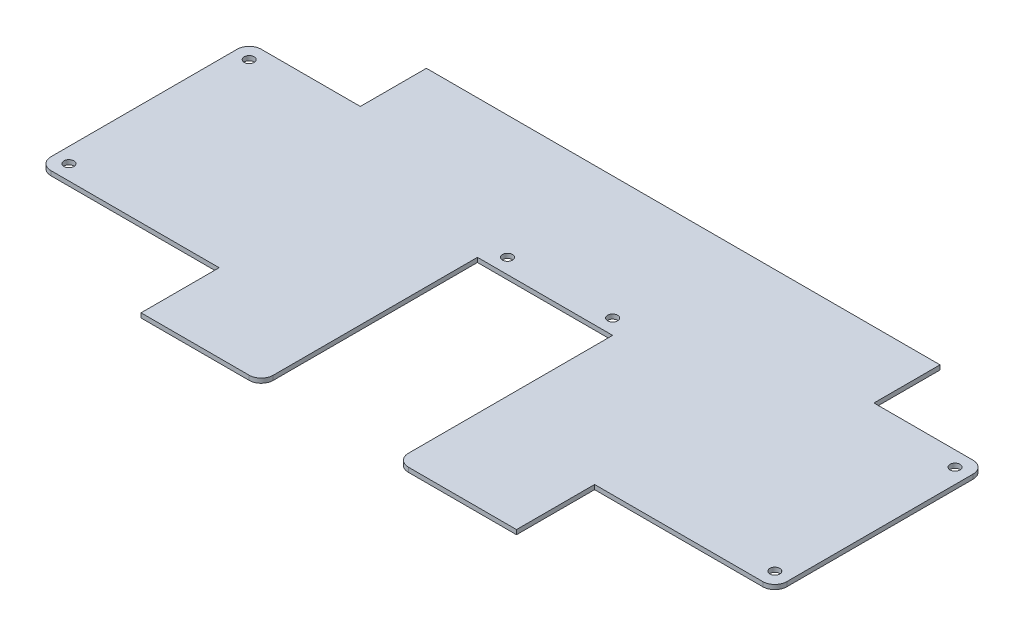
ISO-10303-21;
HEADER;
FILE_DESCRIPTION(('STEP AP214'),'2;1');
FILE_NAME('part.step','',(''),(''),'','','');
FILE_SCHEMA(('AUTOMOTIVE_DESIGN { 1 0 10303 214 1 1 1 1 }'));
ENDSEC;
DATA;
#1=APPLICATION_CONTEXT('core data for automotive mechanical design processes');
#2=APPLICATION_PROTOCOL_DEFINITION('international standard','automotive_design',2000,#1);
#3=PRODUCT_CONTEXT('',#1,'mechanical');
#4=PRODUCT('Part','Part','',(#3));
#5=PRODUCT_RELATED_PRODUCT_CATEGORY('part','',(#4));
#6=PRODUCT_DEFINITION_FORMATION('','',#4);
#7=PRODUCT_DEFINITION_CONTEXT('part definition',#1,'design');
#8=PRODUCT_DEFINITION('design','',#6,#7);
#9=PRODUCT_DEFINITION_SHAPE('','',#8);
#10=(LENGTH_UNIT() NAMED_UNIT(*) SI_UNIT(.MILLI.,.METRE.));
#11=(NAMED_UNIT(*) PLANE_ANGLE_UNIT() SI_UNIT($,.RADIAN.));
#12=(NAMED_UNIT(*) SI_UNIT($,.STERADIAN.) SOLID_ANGLE_UNIT());
#13=UNCERTAINTY_MEASURE_WITH_UNIT(LENGTH_MEASURE(1.E-05),#10,'distance_accuracy_value','');
#14=(GEOMETRIC_REPRESENTATION_CONTEXT(3) GLOBAL_UNCERTAINTY_ASSIGNED_CONTEXT((#13)) GLOBAL_UNIT_ASSIGNED_CONTEXT((#10,
#11,#12)) REPRESENTATION_CONTEXT('',''));
#15=CARTESIAN_POINT('',(0.,0.,0.));
#16=DIRECTION('',(0.,0.,1.));
#17=DIRECTION('',(1.,0.,0.));
#18=AXIS2_PLACEMENT_3D('',#15,#16,#17);
#19=CARTESIAN_POINT('',(0.,1.5,0.));
#20=DIRECTION('',(0.,0.,-1.));
#21=DIRECTION('',(-1.,0.,0.));
#22=AXIS2_PLACEMENT_3D('',#19,#20,#21);
#23=PLANE('',#22);
#24=DIRECTION('',(1.,0.,0.));
#25=VECTOR('',#24,1.);
#26=CARTESIAN_POINT('',(0.,0.,0.));
#27=LINE('',#26,#25);
#28=CARTESIAN_POINT('',(60.,0.,0.));
#29=VERTEX_POINT('',#28);
#30=CARTESIAN_POINT('',(96.,0.,0.));
#31=VERTEX_POINT('',#30);
#32=EDGE_CURVE('E186',#29,#31,#27,.T.);
#33=ORIENTED_EDGE('',*,*,#32,.T.);
#34=DIRECTION('',(0.,1.,0.));
#35=VECTOR('',#34,1.);
#36=CARTESIAN_POINT('',(96.,1.5,0.));
#37=LINE('',#36,#35);
#38=CARTESIAN_POINT('',(96.,1.5,0.));
#39=VERTEX_POINT('',#38);
#40=EDGE_CURVE('E293',#31,#39,#37,.T.);
#41=ORIENTED_EDGE('',*,*,#40,.T.);
#42=DIRECTION('',(1.,0.,0.));
#43=VECTOR('',#42,1.);
#44=CARTESIAN_POINT('',(0.,1.5,0.));
#45=LINE('',#44,#43);
#46=CARTESIAN_POINT('',(60.,1.5,0.));
#47=VERTEX_POINT('',#46);
#48=EDGE_CURVE('E286',#47,#39,#45,.T.);
#49=ORIENTED_EDGE('',*,*,#48,.F.);
#50=DIRECTION('',(0.,1.,0.));
#51=VECTOR('',#50,1.);
#52=CARTESIAN_POINT('',(60.,0.,0.));
#53=LINE('',#52,#51);
#54=EDGE_CURVE('E241',#29,#47,#53,.T.);
#55=ORIENTED_EDGE('',*,*,#54,.F.);
#56=EDGE_LOOP('',(#33,#41,#49,#55));
#57=FACE_BOUND('',#56,.T.);
#58=ADVANCED_FACE('F33',(#57),#23,.F.);
#59=CARTESIAN_POINT('',(0.,1.5,0.));
#60=DIRECTION('',(1.,0.,0.));
#61=DIRECTION('',(0.,0.,-1.));
#62=AXIS2_PLACEMENT_3D('',#59,#60,#61);
#63=PLANE('',#62);
#64=DIRECTION('',(0.,0.,1.));
#65=VECTOR('',#64,1.);
#66=CARTESIAN_POINT('',(0.,0.,0.));
#67=LINE('',#66,#65);
#68=CARTESIAN_POINT('',(0.,0.,-92.));
#69=VERTEX_POINT('',#68);
#70=CARTESIAN_POINT('',(0.,0.,-30.));
#71=VERTEX_POINT('',#70);
#72=EDGE_CURVE('E187',#69,#71,#67,.T.);
#73=ORIENTED_EDGE('',*,*,#72,.T.);
#74=DIRECTION('',(0.,1.,0.));
#75=VECTOR('',#74,1.);
#76=CARTESIAN_POINT('',(0.,1.5,-30.));
#77=LINE('',#76,#75);
#78=CARTESIAN_POINT('',(0.,1.5,-30.));
#79=VERTEX_POINT('',#78);
#80=EDGE_CURVE('E344',#71,#79,#77,.T.);
#81=ORIENTED_EDGE('',*,*,#80,.T.);
#82=DIRECTION('',(0.,0.,1.));
#83=VECTOR('',#82,1.);
#84=CARTESIAN_POINT('',(0.,1.5,0.));
#85=LINE('',#84,#83);
#86=CARTESIAN_POINT('',(0.,1.5,-92.));
#87=VERTEX_POINT('',#86);
#88=EDGE_CURVE('E280',#87,#79,#85,.T.);
#89=ORIENTED_EDGE('',*,*,#88,.F.);
#90=DIRECTION('',(0.,1.,0.));
#91=VECTOR('',#90,1.);
#92=CARTESIAN_POINT('',(0.,1.5,-92.));
#93=LINE('',#92,#91);
#94=EDGE_CURVE('E342',#87,#69,#93,.F.);
#95=ORIENTED_EDGE('',*,*,#94,.T.);
#96=EDGE_LOOP('',(#73,#81,#89,#95));
#97=FACE_BOUND('',#96,.T.);
#98=ADVANCED_FACE('F359',(#97),#63,.F.);
#99=CARTESIAN_POINT('',(149.,1.5,0.));
#100=VERTEX_POINT('',#99);
#101=CARTESIAN_POINT('',(185.,1.5,0.));
#102=VERTEX_POINT('',#101);
#103=EDGE_CURVE('E283',#100,#102,#45,.T.);
#104=ORIENTED_EDGE('',*,*,#103,.F.);
#105=DIRECTION('',(0.,1.,0.));
#106=VECTOR('',#105,1.);
#107=CARTESIAN_POINT('',(149.,1.5,0.));
#108=LINE('',#107,#106);
#109=CARTESIAN_POINT('',(149.,0.,0.));
#110=VERTEX_POINT('',#109);
#111=EDGE_CURVE('E56',#100,#110,#108,.F.);
#112=ORIENTED_EDGE('',*,*,#111,.T.);
#113=CARTESIAN_POINT('',(185.,0.,0.));
#114=VERTEX_POINT('',#113);
#115=EDGE_CURVE('E181',#110,#114,#27,.T.);
#116=ORIENTED_EDGE('',*,*,#115,.T.);
#117=DIRECTION('',(0.,1.,0.));
#118=VECTOR('',#117,1.);
#119=CARTESIAN_POINT('',(185.,0.,0.));
#120=LINE('',#119,#118);
#121=EDGE_CURVE('E184',#114,#102,#120,.T.);
#122=ORIENTED_EDGE('',*,*,#121,.T.);
#123=EDGE_LOOP('',(#104,#112,#116,#122));
#124=FACE_BOUND('',#123,.T.);
#125=ADVANCED_FACE('F183',(#124),#23,.F.);
#126=CARTESIAN_POINT('',(245.,1.5,0.));
#127=DIRECTION('',(-1.,0.,0.));
#128=DIRECTION('',(0.,0.,1.));
#129=AXIS2_PLACEMENT_3D('',#126,#127,#128);
#130=PLANE('',#129);
#131=DIRECTION('',(0.,0.,-1.));
#132=VECTOR('',#131,1.);
#133=CARTESIAN_POINT('',(245.,1.5,0.));
#134=LINE('',#133,#132);
#135=CARTESIAN_POINT('',(245.,1.5,-30.));
#136=VERTEX_POINT('',#135);
#137=CARTESIAN_POINT('',(245.,1.5,-92.));
#138=VERTEX_POINT('',#137);
#139=EDGE_CURVE('E287',#136,#138,#134,.T.);
#140=ORIENTED_EDGE('',*,*,#139,.F.);
#141=DIRECTION('',(0.,1.,0.));
#142=VECTOR('',#141,1.);
#143=CARTESIAN_POINT('',(245.,1.5,-30.));
#144=LINE('',#143,#142);
#145=CARTESIAN_POINT('',(245.,0.,-30.));
#146=VERTEX_POINT('',#145);
#147=EDGE_CURVE('E338',#136,#146,#144,.F.);
#148=ORIENTED_EDGE('',*,*,#147,.T.);
#149=DIRECTION('',(0.,0.,-1.));
#150=VECTOR('',#149,1.);
#151=CARTESIAN_POINT('',(245.,0.,0.));
#152=LINE('',#151,#150);
#153=CARTESIAN_POINT('',(245.,0.,-92.));
#154=VERTEX_POINT('',#153);
#155=EDGE_CURVE('E296',#146,#154,#152,.T.);
#156=ORIENTED_EDGE('',*,*,#155,.T.);
#157=DIRECTION('',(0.,1.,0.));
#158=VECTOR('',#157,1.);
#159=CARTESIAN_POINT('',(245.,1.5,-92.));
#160=LINE('',#159,#158);
#161=EDGE_CURVE('E335',#154,#138,#160,.T.);
#162=ORIENTED_EDGE('',*,*,#161,.T.);
#163=EDGE_LOOP('',(#140,#148,#156,#162));
#164=FACE_BOUND('',#163,.T.);
#165=ADVANCED_FACE('F395',(#164),#130,.F.);
#166=CARTESIAN_POINT('',(0.,1.5,-118.));
#167=DIRECTION('',(0.,0.,1.));
#168=DIRECTION('',(1.,0.,0.));
#169=AXIS2_PLACEMENT_3D('',#166,#167,#168);
#170=PLANE('',#169);
#171=DIRECTION('',(-1.,0.,0.));
#172=VECTOR('',#171,1.);
#173=CARTESIAN_POINT('',(0.,1.5,-118.));
#174=LINE('',#173,#172);
#175=CARTESIAN_POINT('',(208.,1.5,-118.));
#176=VERTEX_POINT('',#175);
#177=CARTESIAN_POINT('',(37.,1.5,-118.));
#178=VERTEX_POINT('',#177);
#179=EDGE_CURVE('E290',#176,#178,#174,.T.);
#180=ORIENTED_EDGE('',*,*,#179,.F.);
#181=DIRECTION('',(0.,1.,0.));
#182=VECTOR('',#181,1.);
#183=CARTESIAN_POINT('',(208.,0.,-118.));
#184=LINE('',#183,#182);
#185=CARTESIAN_POINT('',(208.,0.,-118.));
#186=VERTEX_POINT('',#185);
#187=EDGE_CURVE('E259',#186,#176,#184,.T.);
#188=ORIENTED_EDGE('',*,*,#187,.F.);
#189=DIRECTION('',(-1.,0.,0.));
#190=VECTOR('',#189,1.);
#191=CARTESIAN_POINT('',(0.,0.,-118.));
#192=LINE('',#191,#190);
#193=CARTESIAN_POINT('',(37.,0.,-118.));
#194=VERTEX_POINT('',#193);
#195=EDGE_CURVE('E284',#186,#194,#192,.T.);
#196=ORIENTED_EDGE('',*,*,#195,.T.);
#197=DIRECTION('',(0.,1.,0.));
#198=VECTOR('',#197,1.);
#199=CARTESIAN_POINT('',(37.,0.,-118.));
#200=LINE('',#199,#198);
#201=EDGE_CURVE('E275',#194,#178,#200,.T.);
#202=ORIENTED_EDGE('',*,*,#201,.T.);
#203=EDGE_LOOP('',(#180,#188,#196,#202));
#204=FACE_BOUND('',#203,.T.);
#205=ADVANCED_FACE('F379',(#204),#170,.F.);
#206=CARTESIAN_POINT('',(0.,1.5,0.));
#207=DIRECTION('',(0.,-1.,0.));
#208=DIRECTION('',(0.,0.,-1.));
#209=AXIS2_PLACEMENT_3D('',#206,#207,#208);
#210=PLANE('',#209);
#211=CARTESIAN_POINT('',(5.,1.5,-91.));
#212=DIRECTION('',(0.,-1.,0.));
#213=DIRECTION('',(0.,0.,-1.));
#214=AXIS2_PLACEMENT_3D('',#211,#212,#213);
#215=CIRCLE('',#214,1.65);
#216=CARTESIAN_POINT('',(5.,1.5,-92.65));
#217=VERTEX_POINT('',#216);
#218=EDGE_CURVE('E227',#217,#217,#215,.T.);
#219=ORIENTED_EDGE('',*,*,#218,.T.);
#220=EDGE_LOOP('',(#219));
#221=FACE_BOUND('',#220,.T.);
#222=CARTESIAN_POINT('',(105.,1.5,-77.));
#223=DIRECTION('',(0.,-1.,0.));
#224=DIRECTION('',(0.,0.,-1.));
#225=AXIS2_PLACEMENT_3D('',#222,#223,#224);
#226=CIRCLE('',#225,1.65);
#227=CARTESIAN_POINT('',(105.,1.5,-78.65));
#228=VERTEX_POINT('',#227);
#229=EDGE_CURVE('E689',#228,#228,#226,.T.);
#230=ORIENTED_EDGE('',*,*,#229,.T.);
#231=EDGE_LOOP('',(#230));
#232=FACE_BOUND('',#231,.T.);
#233=CARTESIAN_POINT('',(140.,1.5,-77.));
#234=DIRECTION('',(0.,-1.,0.));
#235=DIRECTION('',(0.,0.,-1.));
#236=AXIS2_PLACEMENT_3D('',#233,#234,#235);
#237=CIRCLE('',#236,1.65000000000002);
#238=CARTESIAN_POINT('',(140.,1.5,-78.65));
#239=VERTEX_POINT('',#238);
#240=EDGE_CURVE('E691',#239,#239,#237,.T.);
#241=ORIENTED_EDGE('',*,*,#240,.T.);
#242=EDGE_LOOP('',(#241));
#243=FACE_BOUND('',#242,.T.);
#244=CARTESIAN_POINT('',(240.,1.5,-31.));
#245=DIRECTION('',(0.,-1.,0.));
#246=DIRECTION('',(0.,0.,-1.));
#247=AXIS2_PLACEMENT_3D('',#244,#245,#246);
#248=CIRCLE('',#247,1.65000000000002);
#249=CARTESIAN_POINT('',(240.,1.5,-32.65));
#250=VERTEX_POINT('',#249);
#251=EDGE_CURVE('E696',#250,#250,#248,.T.);
#252=ORIENTED_EDGE('',*,*,#251,.T.);
#253=EDGE_LOOP('',(#252));
#254=FACE_BOUND('',#253,.T.);
#255=CARTESIAN_POINT('',(240.,1.5,-91.));
#256=DIRECTION('',(0.,-1.,0.));
#257=DIRECTION('',(0.,0.,-1.));
#258=AXIS2_PLACEMENT_3D('',#255,#256,#257);
#259=CIRCLE('',#258,1.65000000000002);
#260=CARTESIAN_POINT('',(240.,1.5,-92.65));
#261=VERTEX_POINT('',#260);
#262=EDGE_CURVE('E699',#261,#261,#259,.T.);
#263=ORIENTED_EDGE('',*,*,#262,.T.);
#264=EDGE_LOOP('',(#263));
#265=FACE_BOUND('',#264,.T.);
#266=CARTESIAN_POINT('',(5.,1.5,-31.));
#267=DIRECTION('',(0.,-1.,0.));
#268=DIRECTION('',(0.,0.,-1.));
#269=AXIS2_PLACEMENT_3D('',#266,#267,#268);
#270=CIRCLE('',#269,1.65);
#271=CARTESIAN_POINT('',(5.,1.5,-32.65));
#272=VERTEX_POINT('',#271);
#273=EDGE_CURVE('E702',#272,#272,#270,.T.);
#274=ORIENTED_EDGE('',*,*,#273,.T.);
#275=EDGE_LOOP('',(#274));
#276=FACE_BOUND('',#275,.T.);
#277=ORIENTED_EDGE('',*,*,#48,.T.);
#278=CARTESIAN_POINT('',(96.,1.5,-4.));
#279=DIRECTION('',(0.,-1.,0.));
#280=DIRECTION('',(0.,0.,-1.));
#281=AXIS2_PLACEMENT_3D('',#278,#279,#280);
#282=CIRCLE('',#281,4.);
#283=CARTESIAN_POINT('',(100.,1.5,-4.));
#284=VERTEX_POINT('',#283);
#285=EDGE_CURVE('E313',#39,#284,#282,.F.);
#286=ORIENTED_EDGE('',*,*,#285,.T.);
#287=DIRECTION('',(0.,0.,1.));
#288=VECTOR('',#287,1.);
#289=CARTESIAN_POINT('',(100.,1.5,0.));
#290=LINE('',#289,#288);
#291=CARTESIAN_POINT('',(100.,1.5,-72.));
#292=VERTEX_POINT('',#291);
#293=EDGE_CURVE('E223',#292,#284,#290,.T.);
#294=ORIENTED_EDGE('',*,*,#293,.F.);
#295=DIRECTION('',(-1.,0.,0.));
#296=VECTOR('',#295,1.);
#297=CARTESIAN_POINT('',(100.,1.5,-72.));
#298=LINE('',#297,#296);
#299=CARTESIAN_POINT('',(145.,1.5,-72.));
#300=VERTEX_POINT('',#299);
#301=EDGE_CURVE('E217',#300,#292,#298,.T.);
#302=ORIENTED_EDGE('',*,*,#301,.F.);
#303=DIRECTION('',(0.,0.,-1.));
#304=VECTOR('',#303,1.);
#305=CARTESIAN_POINT('',(145.,1.5,0.));
#306=LINE('',#305,#304);
#307=CARTESIAN_POINT('',(145.,1.5,-4.));
#308=VERTEX_POINT('',#307);
#309=EDGE_CURVE('E226',#308,#300,#306,.T.);
#310=ORIENTED_EDGE('',*,*,#309,.F.);
#311=CARTESIAN_POINT('',(149.,1.5,-4.));
#312=DIRECTION('',(0.,-1.,0.));
#313=DIRECTION('',(0.,0.,-1.));
#314=AXIS2_PLACEMENT_3D('',#311,#312,#313);
#315=CIRCLE('',#314,4.);
#316=EDGE_CURVE('E311',#308,#100,#315,.F.);
#317=ORIENTED_EDGE('',*,*,#316,.T.);
#318=ORIENTED_EDGE('',*,*,#103,.T.);
#319=DIRECTION('',(0.,0.,1.));
#320=VECTOR('',#319,1.);
#321=CARTESIAN_POINT('',(185.,1.5,0.));
#322=LINE('',#321,#320);
#323=CARTESIAN_POINT('',(185.,1.5,-26.));
#324=VERTEX_POINT('',#323);
#325=EDGE_CURVE('E197',#324,#102,#322,.T.);
#326=ORIENTED_EDGE('',*,*,#325,.F.);
#327=DIRECTION('',(-1.,0.,0.));
#328=VECTOR('',#327,1.);
#329=CARTESIAN_POINT('',(245.,1.5,-26.));
#330=LINE('',#329,#328);
#331=CARTESIAN_POINT('',(241.,1.5,-26.));
#332=VERTEX_POINT('',#331);
#333=EDGE_CURVE('E210',#332,#324,#330,.T.);
#334=ORIENTED_EDGE('',*,*,#333,.F.);
#335=CARTESIAN_POINT('',(241.,1.5,-30.));
#336=DIRECTION('',(0.,-1.,0.));
#337=DIRECTION('',(0.,0.,-1.));
#338=AXIS2_PLACEMENT_3D('',#335,#336,#337);
#339=CIRCLE('',#338,4.);
#340=EDGE_CURVE('E309',#332,#136,#339,.F.);
#341=ORIENTED_EDGE('',*,*,#340,.T.);
#342=ORIENTED_EDGE('',*,*,#139,.T.);
#343=CARTESIAN_POINT('',(241.,1.5,-92.));
#344=DIRECTION('',(0.,-1.,0.));
#345=DIRECTION('',(0.,0.,-1.));
#346=AXIS2_PLACEMENT_3D('',#343,#344,#345);
#347=CIRCLE('',#346,4.);
#348=CARTESIAN_POINT('',(241.,1.5,-96.));
#349=VERTEX_POINT('',#348);
#350=EDGE_CURVE('E307',#138,#349,#347,.F.);
#351=ORIENTED_EDGE('',*,*,#350,.T.);
#352=DIRECTION('',(1.,0.,0.));
#353=VECTOR('',#352,1.);
#354=CARTESIAN_POINT('',(245.,1.5,-96.));
#355=LINE('',#354,#353);
#356=CARTESIAN_POINT('',(208.,1.5,-96.));
#357=VERTEX_POINT('',#356);
#358=EDGE_CURVE('E256',#357,#349,#355,.T.);
#359=ORIENTED_EDGE('',*,*,#358,.F.);
#360=DIRECTION('',(0.,0.,1.));
#361=VECTOR('',#360,1.);
#362=CARTESIAN_POINT('',(208.,1.5,-118.));
#363=LINE('',#362,#361);
#364=EDGE_CURVE('E198',#176,#357,#363,.T.);
#365=ORIENTED_EDGE('',*,*,#364,.F.);
#366=ORIENTED_EDGE('',*,*,#179,.T.);
#367=DIRECTION('',(0.,0.,-1.));
#368=VECTOR('',#367,1.);
#369=CARTESIAN_POINT('',(37.,1.5,-118.));
#370=LINE('',#369,#368);
#371=CARTESIAN_POINT('',(37.,1.5,-96.));
#372=VERTEX_POINT('',#371);
#373=EDGE_CURVE('E269',#372,#178,#370,.T.);
#374=ORIENTED_EDGE('',*,*,#373,.F.);
#375=DIRECTION('',(1.,0.,0.));
#376=VECTOR('',#375,1.);
#377=CARTESIAN_POINT('',(0.,1.5,-96.));
#378=LINE('',#377,#376);
#379=CARTESIAN_POINT('',(4.,1.5,-96.));
#380=VERTEX_POINT('',#379);
#381=EDGE_CURVE('E250',#380,#372,#378,.T.);
#382=ORIENTED_EDGE('',*,*,#381,.F.);
#383=CARTESIAN_POINT('',(4.,1.5,-92.));
#384=DIRECTION('',(0.,-1.,0.));
#385=DIRECTION('',(0.,0.,-1.));
#386=AXIS2_PLACEMENT_3D('',#383,#384,#385);
#387=CIRCLE('',#386,4.);
#388=EDGE_CURVE('E303',#380,#87,#387,.F.);
#389=ORIENTED_EDGE('',*,*,#388,.T.);
#390=ORIENTED_EDGE('',*,*,#88,.T.);
#391=CARTESIAN_POINT('',(4.,1.5,-30.));
#392=DIRECTION('',(0.,-1.,0.));
#393=DIRECTION('',(0.,0.,-1.));
#394=AXIS2_PLACEMENT_3D('',#391,#392,#393);
#395=CIRCLE('',#394,4.);
#396=CARTESIAN_POINT('',(4.,1.5,-26.));
#397=VERTEX_POINT('',#396);
#398=EDGE_CURVE('E305',#79,#397,#395,.F.);
#399=ORIENTED_EDGE('',*,*,#398,.T.);
#400=DIRECTION('',(-1.,0.,0.));
#401=VECTOR('',#400,1.);
#402=CARTESIAN_POINT('',(0.,1.5,-26.));
#403=LINE('',#402,#401);
#404=CARTESIAN_POINT('',(60.,1.5,-26.));
#405=VERTEX_POINT('',#404);
#406=EDGE_CURVE('E238',#405,#397,#403,.T.);
#407=ORIENTED_EDGE('',*,*,#406,.F.);
#408=DIRECTION('',(0.,0.,-1.));
#409=VECTOR('',#408,1.);
#410=CARTESIAN_POINT('',(60.,1.5,0.));
#411=LINE('',#410,#409);
#412=EDGE_CURVE('E242',#47,#405,#411,.T.);
#413=ORIENTED_EDGE('',*,*,#412,.F.);
#414=EDGE_LOOP('',(#277,#286,#294,#302,#310,#317,#318,#326,#334,#341,#342,#351,#359,#365,#366,
#374,#382,#389,#390,#399,#407,#413));
#415=FACE_BOUND('',#414,.T.);
#416=ADVANCED_FACE('F363',(#221,#232,#243,#254,#265,#276,#415),#210,.F.);
#417=CARTESIAN_POINT('',(0.,0.,0.));
#418=DIRECTION('',(0.,-1.,0.));
#419=DIRECTION('',(0.,0.,-1.));
#420=AXIS2_PLACEMENT_3D('',#417,#418,#419);
#421=PLANE('',#420);
#422=CARTESIAN_POINT('',(5.,0.,-91.));
#423=DIRECTION('',(0.,-1.,0.));
#424=DIRECTION('',(0.,0.,-1.));
#425=AXIS2_PLACEMENT_3D('',#422,#423,#424);
#426=CIRCLE('',#425,1.65);
#427=CARTESIAN_POINT('',(5.,0.,-92.65));
#428=VERTEX_POINT('',#427);
#429=EDGE_CURVE('E686',#428,#428,#426,.T.);
#430=ORIENTED_EDGE('',*,*,#429,.F.);
#431=EDGE_LOOP('',(#430));
#432=FACE_BOUND('',#431,.T.);
#433=CARTESIAN_POINT('',(105.,0.,-77.));
#434=DIRECTION('',(0.,-1.,0.));
#435=DIRECTION('',(0.,0.,-1.));
#436=AXIS2_PLACEMENT_3D('',#433,#434,#435);
#437=CIRCLE('',#436,1.65);
#438=CARTESIAN_POINT('',(105.,0.,-78.65));
#439=VERTEX_POINT('',#438);
#440=EDGE_CURVE('E715',#439,#439,#437,.T.);
#441=ORIENTED_EDGE('',*,*,#440,.F.);
#442=EDGE_LOOP('',(#441));
#443=FACE_BOUND('',#442,.T.);
#444=CARTESIAN_POINT('',(140.,0.,-77.));
#445=DIRECTION('',(0.,-1.,0.));
#446=DIRECTION('',(0.,0.,-1.));
#447=AXIS2_PLACEMENT_3D('',#444,#445,#446);
#448=CIRCLE('',#447,1.65000000000002);
#449=CARTESIAN_POINT('',(140.,0.,-78.65));
#450=VERTEX_POINT('',#449);
#451=EDGE_CURVE('E711',#450,#450,#448,.T.);
#452=ORIENTED_EDGE('',*,*,#451,.F.);
#453=EDGE_LOOP('',(#452));
#454=FACE_BOUND('',#453,.T.);
#455=CARTESIAN_POINT('',(240.,0.,-31.));
#456=DIRECTION('',(0.,-1.,0.));
#457=DIRECTION('',(0.,0.,1.));
#458=AXIS2_PLACEMENT_3D('',#455,#456,#457);
#459=CIRCLE('',#458,1.65000000000002);
#460=CARTESIAN_POINT('',(240.,0.,-29.35));
#461=VERTEX_POINT('',#460);
#462=EDGE_CURVE('E708',#461,#461,#459,.T.);
#463=ORIENTED_EDGE('',*,*,#462,.F.);
#464=EDGE_LOOP('',(#463));
#465=FACE_BOUND('',#464,.T.);
#466=CARTESIAN_POINT('',(240.,0.,-91.));
#467=DIRECTION('',(0.,-1.,0.));
#468=DIRECTION('',(0.,0.,1.));
#469=AXIS2_PLACEMENT_3D('',#466,#467,#468);
#470=CIRCLE('',#469,1.65000000000002);
#471=CARTESIAN_POINT('',(240.,0.,-89.35));
#472=VERTEX_POINT('',#471);
#473=EDGE_CURVE('E712',#472,#472,#470,.T.);
#474=ORIENTED_EDGE('',*,*,#473,.F.);
#475=EDGE_LOOP('',(#474));
#476=FACE_BOUND('',#475,.T.);
#477=CARTESIAN_POINT('',(5.,0.,-31.));
#478=DIRECTION('',(0.,-1.,0.));
#479=DIRECTION('',(0.,0.,-1.));
#480=AXIS2_PLACEMENT_3D('',#477,#478,#479);
#481=CIRCLE('',#480,1.65);
#482=CARTESIAN_POINT('',(5.,0.,-32.65));
#483=VERTEX_POINT('',#482);
#484=EDGE_CURVE('E705',#483,#483,#481,.T.);
#485=ORIENTED_EDGE('',*,*,#484,.F.);
#486=EDGE_LOOP('',(#485));
#487=FACE_BOUND('',#486,.T.);
#488=DIRECTION('',(0.,0.,1.));
#489=VECTOR('',#488,1.);
#490=CARTESIAN_POINT('',(100.,0.,0.));
#491=LINE('',#490,#489);
#492=CARTESIAN_POINT('',(100.,0.,-72.));
#493=VERTEX_POINT('',#492);
#494=CARTESIAN_POINT('',(100.,0.,-4.));
#495=VERTEX_POINT('',#494);
#496=EDGE_CURVE('E214',#493,#495,#491,.T.);
#497=ORIENTED_EDGE('',*,*,#496,.T.);
#498=CARTESIAN_POINT('',(96.,0.,-4.));
#499=DIRECTION('',(0.,-1.,0.));
#500=DIRECTION('',(0.,0.,-1.));
#501=AXIS2_PLACEMENT_3D('',#498,#499,#500);
#502=CIRCLE('',#501,4.);
#503=EDGE_CURVE('E326',#495,#31,#502,.T.);
#504=ORIENTED_EDGE('',*,*,#503,.T.);
#505=ORIENTED_EDGE('',*,*,#32,.F.);
#506=DIRECTION('',(0.,0.,-1.));
#507=VECTOR('',#506,1.);
#508=CARTESIAN_POINT('',(60.,0.,0.));
#509=LINE('',#508,#507);
#510=CARTESIAN_POINT('',(60.,0.,-26.));
#511=VERTEX_POINT('',#510);
#512=EDGE_CURVE('E234',#29,#511,#509,.T.);
#513=ORIENTED_EDGE('',*,*,#512,.T.);
#514=DIRECTION('',(-1.,0.,0.));
#515=VECTOR('',#514,1.);
#516=CARTESIAN_POINT('',(0.,0.,-26.));
#517=LINE('',#516,#515);
#518=CARTESIAN_POINT('',(4.,0.,-26.));
#519=VERTEX_POINT('',#518);
#520=EDGE_CURVE('E237',#511,#519,#517,.T.);
#521=ORIENTED_EDGE('',*,*,#520,.T.);
#522=CARTESIAN_POINT('',(4.,0.,-30.));
#523=DIRECTION('',(0.,-1.,0.));
#524=DIRECTION('',(0.,0.,-1.));
#525=AXIS2_PLACEMENT_3D('',#522,#523,#524);
#526=CIRCLE('',#525,4.);
#527=EDGE_CURVE('E319',#519,#71,#526,.T.);
#528=ORIENTED_EDGE('',*,*,#527,.T.);
#529=ORIENTED_EDGE('',*,*,#72,.F.);
#530=CARTESIAN_POINT('',(4.,0.,-92.));
#531=DIRECTION('',(0.,-1.,0.));
#532=DIRECTION('',(0.,0.,-1.));
#533=AXIS2_PLACEMENT_3D('',#530,#531,#532);
#534=CIRCLE('',#533,4.);
#535=CARTESIAN_POINT('',(4.,0.,-96.));
#536=VERTEX_POINT('',#535);
#537=EDGE_CURVE('E317',#69,#536,#534,.T.);
#538=ORIENTED_EDGE('',*,*,#537,.T.);
#539=DIRECTION('',(1.,0.,0.));
#540=VECTOR('',#539,1.);
#541=CARTESIAN_POINT('',(0.,0.,-96.));
#542=LINE('',#541,#540);
#543=CARTESIAN_POINT('',(37.,0.,-96.));
#544=VERTEX_POINT('',#543);
#545=EDGE_CURVE('E266',#536,#544,#542,.T.);
#546=ORIENTED_EDGE('',*,*,#545,.T.);
#547=DIRECTION('',(0.,0.,-1.));
#548=VECTOR('',#547,1.);
#549=CARTESIAN_POINT('',(37.,0.,-118.));
#550=LINE('',#549,#548);
#551=EDGE_CURVE('E268',#544,#194,#550,.T.);
#552=ORIENTED_EDGE('',*,*,#551,.T.);
#553=ORIENTED_EDGE('',*,*,#195,.F.);
#554=DIRECTION('',(0.,0.,1.));
#555=VECTOR('',#554,1.);
#556=CARTESIAN_POINT('',(208.,0.,-118.));
#557=LINE('',#556,#555);
#558=CARTESIAN_POINT('',(208.,0.,-96.));
#559=VERTEX_POINT('',#558);
#560=EDGE_CURVE('E252',#186,#559,#557,.T.);
#561=ORIENTED_EDGE('',*,*,#560,.T.);
#562=DIRECTION('',(1.,0.,0.));
#563=VECTOR('',#562,1.);
#564=CARTESIAN_POINT('',(245.,0.,-96.));
#565=LINE('',#564,#563);
#566=CARTESIAN_POINT('',(241.,0.,-96.));
#567=VERTEX_POINT('',#566);
#568=EDGE_CURVE('E255',#559,#567,#565,.T.);
#569=ORIENTED_EDGE('',*,*,#568,.T.);
#570=CARTESIAN_POINT('',(241.,0.,-92.));
#571=DIRECTION('',(0.,-1.,0.));
#572=DIRECTION('',(0.,0.,-1.));
#573=AXIS2_PLACEMENT_3D('',#570,#571,#572);
#574=CIRCLE('',#573,4.);
#575=EDGE_CURVE('E321',#567,#154,#574,.T.);
#576=ORIENTED_EDGE('',*,*,#575,.T.);
#577=ORIENTED_EDGE('',*,*,#155,.F.);
#578=CARTESIAN_POINT('',(241.,0.,-30.));
#579=DIRECTION('',(0.,-1.,0.));
#580=DIRECTION('',(0.,0.,-1.));
#581=AXIS2_PLACEMENT_3D('',#578,#579,#580);
#582=CIRCLE('',#581,4.);
#583=CARTESIAN_POINT('',(241.,0.,-26.));
#584=VERTEX_POINT('',#583);
#585=EDGE_CURVE('E323',#146,#584,#582,.T.);
#586=ORIENTED_EDGE('',*,*,#585,.T.);
#587=DIRECTION('',(-1.,0.,0.));
#588=VECTOR('',#587,1.);
#589=CARTESIAN_POINT('',(245.,0.,-26.));
#590=LINE('',#589,#588);
#591=CARTESIAN_POINT('',(185.,0.,-26.));
#592=VERTEX_POINT('',#591);
#593=EDGE_CURVE('E204',#584,#592,#590,.T.);
#594=ORIENTED_EDGE('',*,*,#593,.T.);
#595=DIRECTION('',(0.,0.,1.));
#596=VECTOR('',#595,1.);
#597=CARTESIAN_POINT('',(185.,0.,0.));
#598=LINE('',#597,#596);
#599=EDGE_CURVE('E194',#592,#114,#598,.T.);
#600=ORIENTED_EDGE('',*,*,#599,.T.);
#601=ORIENTED_EDGE('',*,*,#115,.F.);
#602=CARTESIAN_POINT('',(149.,0.,-4.));
#603=DIRECTION('',(0.,-1.,0.));
#604=DIRECTION('',(0.,0.,-1.));
#605=AXIS2_PLACEMENT_3D('',#602,#603,#604);
#606=CIRCLE('',#605,4.);
#607=CARTESIAN_POINT('',(145.,0.,-4.));
#608=VERTEX_POINT('',#607);
#609=EDGE_CURVE('E48',#110,#608,#606,.T.);
#610=ORIENTED_EDGE('',*,*,#609,.T.);
#611=DIRECTION('',(0.,0.,-1.));
#612=VECTOR('',#611,1.);
#613=CARTESIAN_POINT('',(145.,0.,0.));
#614=LINE('',#613,#612);
#615=CARTESIAN_POINT('',(145.,0.,-72.));
#616=VERTEX_POINT('',#615);
#617=EDGE_CURVE('E216',#608,#616,#614,.T.);
#618=ORIENTED_EDGE('',*,*,#617,.T.);
#619=DIRECTION('',(-1.,0.,0.));
#620=VECTOR('',#619,1.);
#621=CARTESIAN_POINT('',(100.,0.,-72.));
#622=LINE('',#621,#620);
#623=EDGE_CURVE('E219',#616,#493,#622,.T.);
#624=ORIENTED_EDGE('',*,*,#623,.T.);
#625=EDGE_LOOP('',(#497,#504,#505,#513,#521,#528,#529,#538,#546,#552,#553,#561,#569,#576,#577,
#586,#594,#600,#601,#610,#618,#624));
#626=FACE_BOUND('',#625,.T.);
#627=ADVANCED_FACE('F202',(#432,#443,#454,#465,#476,#487,#626),#421,.T.);
#628=CARTESIAN_POINT('',(37.,0.,-118.));
#629=DIRECTION('',(1.,0.,0.));
#630=DIRECTION('',(0.,0.,-1.));
#631=AXIS2_PLACEMENT_3D('',#628,#629,#630);
#632=PLANE('',#631);
#633=ORIENTED_EDGE('',*,*,#373,.T.);
#634=ORIENTED_EDGE('',*,*,#201,.F.);
#635=ORIENTED_EDGE('',*,*,#551,.F.);
#636=DIRECTION('',(0.,1.,0.));
#637=VECTOR('',#636,1.);
#638=CARTESIAN_POINT('',(37.,0.,-96.));
#639=LINE('',#638,#637);
#640=EDGE_CURVE('E272',#544,#372,#639,.T.);
#641=ORIENTED_EDGE('',*,*,#640,.T.);
#642=EDGE_LOOP('',(#633,#634,#635,#641));
#643=FACE_BOUND('',#642,.T.);
#644=ADVANCED_FACE('F376',(#643),#632,.F.);
#645=CARTESIAN_POINT('',(0.,0.,-96.));
#646=DIRECTION('',(0.,0.,1.));
#647=DIRECTION('',(1.,0.,0.));
#648=AXIS2_PLACEMENT_3D('',#645,#646,#647);
#649=PLANE('',#648);
#650=ORIENTED_EDGE('',*,*,#545,.F.);
#651=DIRECTION('',(0.,1.,0.));
#652=VECTOR('',#651,1.);
#653=CARTESIAN_POINT('',(4.,0.,-96.));
#654=LINE('',#653,#652);
#655=EDGE_CURVE('E11',#536,#380,#654,.T.);
#656=ORIENTED_EDGE('',*,*,#655,.T.);
#657=ORIENTED_EDGE('',*,*,#381,.T.);
#658=ORIENTED_EDGE('',*,*,#640,.F.);
#659=EDGE_LOOP('',(#650,#656,#657,#658));
#660=FACE_BOUND('',#659,.T.);
#661=ADVANCED_FACE('F371',(#660),#649,.F.);
#662=CARTESIAN_POINT('',(100.,0.,0.));
#663=DIRECTION('',(-1.,0.,0.));
#664=DIRECTION('',(0.,0.,1.));
#665=AXIS2_PLACEMENT_3D('',#662,#663,#664);
#666=PLANE('',#665);
#667=ORIENTED_EDGE('',*,*,#293,.T.);
#668=DIRECTION('',(0.,1.,0.));
#669=VECTOR('',#668,1.);
#670=CARTESIAN_POINT('',(100.,0.,-4.));
#671=LINE('',#670,#669);
#672=EDGE_CURVE('E315',#284,#495,#671,.F.);
#673=ORIENTED_EDGE('',*,*,#672,.T.);
#674=ORIENTED_EDGE('',*,*,#496,.F.);
#675=DIRECTION('',(0.,1.,0.));
#676=VECTOR('',#675,1.);
#677=CARTESIAN_POINT('',(100.,0.,-72.));
#678=LINE('',#677,#676);
#679=EDGE_CURVE('E212',#493,#292,#678,.T.);
#680=ORIENTED_EDGE('',*,*,#679,.T.);
#681=EDGE_LOOP('',(#667,#673,#674,#680));
#682=FACE_BOUND('',#681,.T.);
#683=ADVANCED_FACE('F466',(#682),#666,.F.);
#684=CARTESIAN_POINT('',(100.,0.,-72.));
#685=DIRECTION('',(0.,0.,-1.));
#686=DIRECTION('',(-1.,0.,0.));
#687=AXIS2_PLACEMENT_3D('',#684,#685,#686);
#688=PLANE('',#687);
#689=ORIENTED_EDGE('',*,*,#301,.T.);
#690=ORIENTED_EDGE('',*,*,#679,.F.);
#691=ORIENTED_EDGE('',*,*,#623,.F.);
#692=DIRECTION('',(0.,1.,0.));
#693=VECTOR('',#692,1.);
#694=CARTESIAN_POINT('',(145.,0.,-72.));
#695=LINE('',#694,#693);
#696=EDGE_CURVE('E222',#616,#300,#695,.T.);
#697=ORIENTED_EDGE('',*,*,#696,.T.);
#698=EDGE_LOOP('',(#689,#690,#691,#697));
#699=FACE_BOUND('',#698,.T.);
#700=ADVANCED_FACE('F414',(#699),#688,.F.);
#701=CARTESIAN_POINT('',(145.,0.,0.));
#702=DIRECTION('',(1.,0.,0.));
#703=DIRECTION('',(0.,0.,-1.));
#704=AXIS2_PLACEMENT_3D('',#701,#702,#703);
#705=PLANE('',#704);
#706=ORIENTED_EDGE('',*,*,#617,.F.);
#707=DIRECTION('',(0.,1.,0.));
#708=VECTOR('',#707,1.);
#709=CARTESIAN_POINT('',(145.,0.,-4.));
#710=LINE('',#709,#708);
#711=EDGE_CURVE('E328',#608,#308,#710,.T.);
#712=ORIENTED_EDGE('',*,*,#711,.T.);
#713=ORIENTED_EDGE('',*,*,#309,.T.);
#714=ORIENTED_EDGE('',*,*,#696,.F.);
#715=EDGE_LOOP('',(#706,#712,#713,#714));
#716=FACE_BOUND('',#715,.T.);
#717=ADVANCED_FACE('F409',(#716),#705,.F.);
#718=CARTESIAN_POINT('',(185.,0.,0.));
#719=DIRECTION('',(-1.,0.,0.));
#720=DIRECTION('',(0.,0.,1.));
#721=AXIS2_PLACEMENT_3D('',#718,#719,#720);
#722=PLANE('',#721);
#723=ORIENTED_EDGE('',*,*,#325,.T.);
#724=ORIENTED_EDGE('',*,*,#121,.F.);
#725=ORIENTED_EDGE('',*,*,#599,.F.);
#726=DIRECTION('',(0.,1.,0.));
#727=VECTOR('',#726,1.);
#728=CARTESIAN_POINT('',(185.,0.,-26.));
#729=LINE('',#728,#727);
#730=EDGE_CURVE('E199',#592,#324,#729,.T.);
#731=ORIENTED_EDGE('',*,*,#730,.T.);
#732=EDGE_LOOP('',(#723,#724,#725,#731));
#733=FACE_BOUND('',#732,.T.);
#734=ADVANCED_FACE('F192',(#733),#722,.F.);
#735=CARTESIAN_POINT('',(245.,0.,-26.));
#736=DIRECTION('',(0.,0.,-1.));
#737=DIRECTION('',(-1.,0.,0.));
#738=AXIS2_PLACEMENT_3D('',#735,#736,#737);
#739=PLANE('',#738);
#740=ORIENTED_EDGE('',*,*,#593,.F.);
#741=DIRECTION('',(0.,1.,0.));
#742=VECTOR('',#741,1.);
#743=CARTESIAN_POINT('',(241.,0.,-26.));
#744=LINE('',#743,#742);
#745=EDGE_CURVE('E332',#584,#332,#744,.T.);
#746=ORIENTED_EDGE('',*,*,#745,.T.);
#747=ORIENTED_EDGE('',*,*,#333,.T.);
#748=ORIENTED_EDGE('',*,*,#730,.F.);
#749=EDGE_LOOP('',(#740,#746,#747,#748));
#750=FACE_BOUND('',#749,.T.);
#751=ADVANCED_FACE('F403',(#750),#739,.F.);
#752=CARTESIAN_POINT('',(245.,0.,-96.));
#753=DIRECTION('',(0.,0.,1.));
#754=DIRECTION('',(1.,0.,0.));
#755=AXIS2_PLACEMENT_3D('',#752,#753,#754);
#756=PLANE('',#755);
#757=ORIENTED_EDGE('',*,*,#358,.T.);
#758=DIRECTION('',(0.,1.,0.));
#759=VECTOR('',#758,1.);
#760=CARTESIAN_POINT('',(241.,0.,-96.));
#761=LINE('',#760,#759);
#762=EDGE_CURVE('E340',#349,#567,#761,.F.);
#763=ORIENTED_EDGE('',*,*,#762,.T.);
#764=ORIENTED_EDGE('',*,*,#568,.F.);
#765=DIRECTION('',(0.,1.,0.));
#766=VECTOR('',#765,1.);
#767=CARTESIAN_POINT('',(208.,0.,-96.));
#768=LINE('',#767,#766);
#769=EDGE_CURVE('E245',#559,#357,#768,.T.);
#770=ORIENTED_EDGE('',*,*,#769,.T.);
#771=EDGE_LOOP('',(#757,#763,#764,#770));
#772=FACE_BOUND('',#771,.T.);
#773=ADVANCED_FACE('F470',(#772),#756,.F.);
#774=CARTESIAN_POINT('',(208.,0.,-118.));
#775=DIRECTION('',(-1.,0.,0.));
#776=DIRECTION('',(0.,0.,1.));
#777=AXIS2_PLACEMENT_3D('',#774,#775,#776);
#778=PLANE('',#777);
#779=ORIENTED_EDGE('',*,*,#364,.T.);
#780=ORIENTED_EDGE('',*,*,#769,.F.);
#781=ORIENTED_EDGE('',*,*,#560,.F.);
#782=ORIENTED_EDGE('',*,*,#187,.T.);
#783=EDGE_LOOP('',(#779,#780,#781,#782));
#784=FACE_BOUND('',#783,.T.);
#785=ADVANCED_FACE('F385',(#784),#778,.F.);
#786=CARTESIAN_POINT('',(0.,0.,-26.));
#787=DIRECTION('',(0.,0.,-1.));
#788=DIRECTION('',(-1.,0.,0.));
#789=AXIS2_PLACEMENT_3D('',#786,#787,#788);
#790=PLANE('',#789);
#791=ORIENTED_EDGE('',*,*,#406,.T.);
#792=DIRECTION('',(0.,1.,0.));
#793=VECTOR('',#792,1.);
#794=CARTESIAN_POINT('',(4.,0.,-26.));
#795=LINE('',#794,#793);
#796=EDGE_CURVE('E41',#397,#519,#795,.F.);
#797=ORIENTED_EDGE('',*,*,#796,.T.);
#798=ORIENTED_EDGE('',*,*,#520,.F.);
#799=DIRECTION('',(0.,1.,0.));
#800=VECTOR('',#799,1.);
#801=CARTESIAN_POINT('',(60.,0.,-26.));
#802=LINE('',#801,#800);
#803=EDGE_CURVE('E248',#511,#405,#802,.T.);
#804=ORIENTED_EDGE('',*,*,#803,.T.);
#805=EDGE_LOOP('',(#791,#797,#798,#804));
#806=FACE_BOUND('',#805,.T.);
#807=ADVANCED_FACE('F348',(#806),#790,.F.);
#808=CARTESIAN_POINT('',(60.,0.,0.));
#809=DIRECTION('',(1.,0.,0.));
#810=DIRECTION('',(0.,0.,-1.));
#811=AXIS2_PLACEMENT_3D('',#808,#809,#810);
#812=PLANE('',#811);
#813=ORIENTED_EDGE('',*,*,#412,.T.);
#814=ORIENTED_EDGE('',*,*,#803,.F.);
#815=ORIENTED_EDGE('',*,*,#512,.F.);
#816=ORIENTED_EDGE('',*,*,#54,.T.);
#817=EDGE_LOOP('',(#813,#814,#815,#816));
#818=FACE_BOUND('',#817,.T.);
#819=ADVANCED_FACE('F429',(#818),#812,.F.);
#820=CARTESIAN_POINT('',(5.,10.,-31.));
#821=DIRECTION('',(0.,-1.,0.));
#822=DIRECTION('',(0.,0.,-1.));
#823=AXIS2_PLACEMENT_3D('',#820,#821,#822);
#824=CYLINDRICAL_SURFACE('',#823,1.65);
#825=ORIENTED_EDGE('',*,*,#484,.T.);
#826=EDGE_LOOP('',(#825));
#827=FACE_BOUND('',#826,.T.);
#828=ORIENTED_EDGE('',*,*,#273,.F.);
#829=EDGE_LOOP('',(#828));
#830=FACE_BOUND('',#829,.T.);
#831=ADVANCED_FACE('F431',(#827,#830),#824,.F.);
#832=CARTESIAN_POINT('',(240.,10.,-91.));
#833=DIRECTION('',(0.,-1.,0.));
#834=DIRECTION('',(0.,0.,-1.));
#835=AXIS2_PLACEMENT_3D('',#832,#833,#834);
#836=CYLINDRICAL_SURFACE('',#835,1.65000000000002);
#837=ORIENTED_EDGE('',*,*,#473,.T.);
#838=EDGE_LOOP('',(#837));
#839=FACE_BOUND('',#838,.T.);
#840=ORIENTED_EDGE('',*,*,#262,.F.);
#841=EDGE_LOOP('',(#840));
#842=FACE_BOUND('',#841,.T.);
#843=ADVANCED_FACE('F437',(#839,#842),#836,.F.);
#844=CARTESIAN_POINT('',(240.,10.,-31.));
#845=DIRECTION('',(0.,-1.,0.));
#846=DIRECTION('',(0.,0.,-1.));
#847=AXIS2_PLACEMENT_3D('',#844,#845,#846);
#848=CYLINDRICAL_SURFACE('',#847,1.65000000000002);
#849=ORIENTED_EDGE('',*,*,#462,.T.);
#850=EDGE_LOOP('',(#849));
#851=FACE_BOUND('',#850,.T.);
#852=ORIENTED_EDGE('',*,*,#251,.F.);
#853=EDGE_LOOP('',(#852));
#854=FACE_BOUND('',#853,.T.);
#855=ADVANCED_FACE('F531',(#851,#854),#848,.F.);
#856=CARTESIAN_POINT('',(140.,10.,-77.));
#857=DIRECTION('',(0.,-1.,0.));
#858=DIRECTION('',(0.,0.,-1.));
#859=AXIS2_PLACEMENT_3D('',#856,#857,#858);
#860=CYLINDRICAL_SURFACE('',#859,1.65000000000002);
#861=ORIENTED_EDGE('',*,*,#451,.T.);
#862=EDGE_LOOP('',(#861));
#863=FACE_BOUND('',#862,.T.);
#864=ORIENTED_EDGE('',*,*,#240,.F.);
#865=EDGE_LOOP('',(#864));
#866=FACE_BOUND('',#865,.T.);
#867=ADVANCED_FACE('F541',(#863,#866),#860,.F.);
#868=CARTESIAN_POINT('',(105.,10.,-77.));
#869=DIRECTION('',(0.,-1.,0.));
#870=DIRECTION('',(0.,0.,-1.));
#871=AXIS2_PLACEMENT_3D('',#868,#869,#870);
#872=CYLINDRICAL_SURFACE('',#871,1.65);
#873=ORIENTED_EDGE('',*,*,#440,.T.);
#874=EDGE_LOOP('',(#873));
#875=FACE_BOUND('',#874,.T.);
#876=ORIENTED_EDGE('',*,*,#229,.F.);
#877=EDGE_LOOP('',(#876));
#878=FACE_BOUND('',#877,.T.);
#879=ADVANCED_FACE('F551',(#875,#878),#872,.F.);
#880=CARTESIAN_POINT('',(5.,10.,-91.));
#881=DIRECTION('',(0.,-1.,0.));
#882=DIRECTION('',(0.,0.,-1.));
#883=AXIS2_PLACEMENT_3D('',#880,#881,#882);
#884=CYLINDRICAL_SURFACE('',#883,1.65);
#885=ORIENTED_EDGE('',*,*,#429,.T.);
#886=EDGE_LOOP('',(#885));
#887=FACE_BOUND('',#886,.T.);
#888=ORIENTED_EDGE('',*,*,#218,.F.);
#889=EDGE_LOOP('',(#888));
#890=FACE_BOUND('',#889,.T.);
#891=ADVANCED_FACE('F561',(#887,#890),#884,.F.);
#892=CARTESIAN_POINT('',(96.,1.5,-4.));
#893=DIRECTION('',(0.,1.,0.));
#894=DIRECTION('',(0.,0.,1.));
#895=AXIS2_PLACEMENT_3D('',#892,#893,#894);
#896=CYLINDRICAL_SURFACE('',#895,4.);
#897=ORIENTED_EDGE('',*,*,#503,.F.);
#898=ORIENTED_EDGE('',*,*,#672,.F.);
#899=ORIENTED_EDGE('',*,*,#285,.F.);
#900=ORIENTED_EDGE('',*,*,#40,.F.);
#901=EDGE_LOOP('',(#897,#898,#899,#900));
#902=FACE_BOUND('',#901,.T.);
#903=ADVANCED_FACE('F423',(#902),#896,.T.);
#904=CARTESIAN_POINT('',(149.,0.,-4.));
#905=DIRECTION('',(0.,1.,0.));
#906=DIRECTION('',(0.,0.,1.));
#907=AXIS2_PLACEMENT_3D('',#904,#905,#906);
#908=CYLINDRICAL_SURFACE('',#907,4.);
#909=ORIENTED_EDGE('',*,*,#609,.F.);
#910=ORIENTED_EDGE('',*,*,#111,.F.);
#911=ORIENTED_EDGE('',*,*,#316,.F.);
#912=ORIENTED_EDGE('',*,*,#711,.F.);
#913=EDGE_LOOP('',(#909,#910,#911,#912));
#914=FACE_BOUND('',#913,.T.);
#915=ADVANCED_FACE('F406',(#914),#908,.T.);
#916=CARTESIAN_POINT('',(241.,0.,-30.));
#917=DIRECTION('',(0.,1.,0.));
#918=DIRECTION('',(0.,0.,1.));
#919=AXIS2_PLACEMENT_3D('',#916,#917,#918);
#920=CYLINDRICAL_SURFACE('',#919,4.);
#921=ORIENTED_EDGE('',*,*,#585,.F.);
#922=ORIENTED_EDGE('',*,*,#147,.F.);
#923=ORIENTED_EDGE('',*,*,#340,.F.);
#924=ORIENTED_EDGE('',*,*,#745,.F.);
#925=EDGE_LOOP('',(#921,#922,#923,#924));
#926=FACE_BOUND('',#925,.T.);
#927=ADVANCED_FACE('F401',(#926),#920,.T.);
#928=CARTESIAN_POINT('',(241.,1.5,-92.));
#929=DIRECTION('',(0.,1.,0.));
#930=DIRECTION('',(0.,0.,1.));
#931=AXIS2_PLACEMENT_3D('',#928,#929,#930);
#932=CYLINDRICAL_SURFACE('',#931,4.);
#933=ORIENTED_EDGE('',*,*,#575,.F.);
#934=ORIENTED_EDGE('',*,*,#762,.F.);
#935=ORIENTED_EDGE('',*,*,#350,.F.);
#936=ORIENTED_EDGE('',*,*,#161,.F.);
#937=EDGE_LOOP('',(#933,#934,#935,#936));
#938=FACE_BOUND('',#937,.T.);
#939=ADVANCED_FACE('F392',(#938),#932,.T.);
#940=CARTESIAN_POINT('',(4.,1.5,-30.));
#941=DIRECTION('',(0.,1.,0.));
#942=DIRECTION('',(0.,0.,1.));
#943=AXIS2_PLACEMENT_3D('',#940,#941,#942);
#944=CYLINDRICAL_SURFACE('',#943,4.);
#945=ORIENTED_EDGE('',*,*,#527,.F.);
#946=ORIENTED_EDGE('',*,*,#796,.F.);
#947=ORIENTED_EDGE('',*,*,#398,.F.);
#948=ORIENTED_EDGE('',*,*,#80,.F.);
#949=EDGE_LOOP('',(#945,#946,#947,#948));
#950=FACE_BOUND('',#949,.T.);
#951=ADVANCED_FACE('F356',(#950),#944,.T.);
#952=CARTESIAN_POINT('',(4.,0.,-92.));
#953=DIRECTION('',(0.,1.,0.));
#954=DIRECTION('',(0.,0.,1.));
#955=AXIS2_PLACEMENT_3D('',#952,#953,#954);
#956=CYLINDRICAL_SURFACE('',#955,4.);
#957=ORIENTED_EDGE('',*,*,#537,.F.);
#958=ORIENTED_EDGE('',*,*,#94,.F.);
#959=ORIENTED_EDGE('',*,*,#388,.F.);
#960=ORIENTED_EDGE('',*,*,#655,.F.);
#961=EDGE_LOOP('',(#957,#958,#959,#960));
#962=FACE_BOUND('',#961,.T.);
#963=ADVANCED_FACE('F35',(#962),#956,.T.);
#964=CLOSED_SHELL('',(#58,#98,#125,#165,#205,#416,#627,#644,#661,#683,#700,#717,#734,#751,#773,
#785,#807,#819,#831,#843,#855,#867,#879,#891,#903,#915,#927,#939,#951,#963));
#965=MANIFOLD_SOLID_BREP('B2',#964);
#966=ADVANCED_BREP_SHAPE_REPRESENTATION('',(#18,#965),#14);
#967=SHAPE_DEFINITION_REPRESENTATION(#9,#966);
ENDSEC;
END-ISO-10303-21;
